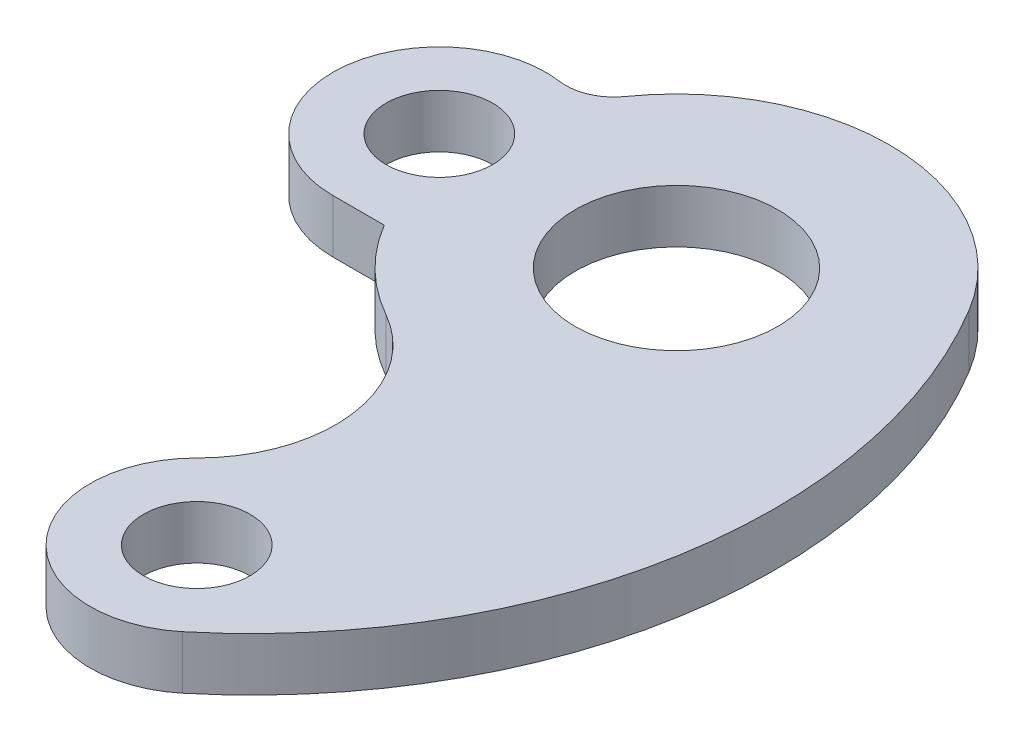
ISO-10303-21;
HEADER;
FILE_DESCRIPTION(('STEP AP214'),'2;1');
FILE_NAME('part.step','',(''),(''),'','','');
FILE_SCHEMA(('AUTOMOTIVE_DESIGN { 1 0 10303 214 1 1 1 1 }'));
ENDSEC;
DATA;
#1=APPLICATION_CONTEXT('core data for automotive mechanical design processes');
#2=APPLICATION_PROTOCOL_DEFINITION('international standard','automotive_design',2000,#1);
#3=PRODUCT_CONTEXT('',#1,'mechanical');
#4=PRODUCT('Part','Part','',(#3));
#5=PRODUCT_RELATED_PRODUCT_CATEGORY('part','',(#4));
#6=PRODUCT_DEFINITION_FORMATION('','',#4);
#7=PRODUCT_DEFINITION_CONTEXT('part definition',#1,'design');
#8=PRODUCT_DEFINITION('design','',#6,#7);
#9=PRODUCT_DEFINITION_SHAPE('','',#8);
#10=(LENGTH_UNIT() NAMED_UNIT(*) SI_UNIT(.MILLI.,.METRE.));
#11=(NAMED_UNIT(*) PLANE_ANGLE_UNIT() SI_UNIT($,.RADIAN.));
#12=(NAMED_UNIT(*) SI_UNIT($,.STERADIAN.) SOLID_ANGLE_UNIT());
#13=UNCERTAINTY_MEASURE_WITH_UNIT(LENGTH_MEASURE(1.E-05),#10,'distance_accuracy_value','');
#14=(GEOMETRIC_REPRESENTATION_CONTEXT(3) GLOBAL_UNCERTAINTY_ASSIGNED_CONTEXT((#13)) GLOBAL_UNIT_ASSIGNED_CONTEXT((#10,
#11,#12)) REPRESENTATION_CONTEXT('',''));
#15=CARTESIAN_POINT('',(0.,0.,0.));
#16=DIRECTION('',(0.,0.,1.));
#17=DIRECTION('',(1.,0.,0.));
#18=AXIS2_PLACEMENT_3D('',#15,#16,#17);
#19=CARTESIAN_POINT('',(-49.7056769492948,10.,29.8888888888889));
#20=DIRECTION('',(0.,-1.,0.));
#21=DIRECTION('',(0.,0.,-1.));
#22=AXIS2_PLACEMENT_3D('',#19,#20,#21);
#23=CYLINDRICAL_SURFACE('',#22,98.);
#24=CARTESIAN_POINT('',(-49.7056769492948,0.,29.8888888888889));
#25=DIRECTION('',(0.,1.,0.));
#26=DIRECTION('',(0.,0.,1.));
#27=AXIS2_PLACEMENT_3D('',#24,#25,#26);
#28=CIRCLE('',#27,98.);
#29=CARTESIAN_POINT('',(12.745045371614,0.,105.413105413105));
#30=VERTEX_POINT('',#29);
#31=CARTESIAN_POINT('',(34.2797772064102,0.,-20.6130268199234));
#32=VERTEX_POINT('',#31);
#33=EDGE_CURVE('E158',#30,#32,#28,.T.);
#34=ORIENTED_EDGE('',*,*,#33,.T.);
#35=DIRECTION('',(0.,-1.,0.));
#36=VECTOR('',#35,1.);
#37=CARTESIAN_POINT('',(34.2797772064102,10.,-20.6130268199234));
#38=LINE('',#37,#36);
#39=CARTESIAN_POINT('',(34.2797772064102,10.,-20.6130268199234));
#40=VERTEX_POINT('',#39);
#41=EDGE_CURVE('E11',#40,#32,#38,.T.);
#42=ORIENTED_EDGE('',*,*,#41,.F.);
#43=CARTESIAN_POINT('',(-49.7056769492948,10.,29.8888888888889));
#44=DIRECTION('',(0.,1.,0.));
#45=DIRECTION('',(0.,0.,1.));
#46=AXIS2_PLACEMENT_3D('',#43,#44,#45);
#47=CIRCLE('',#46,98.);
#48=CARTESIAN_POINT('',(12.745045371614,10.,105.413105413105));
#49=VERTEX_POINT('',#48);
#50=EDGE_CURVE('E225',#49,#40,#47,.T.);
#51=ORIENTED_EDGE('',*,*,#50,.F.);
#52=DIRECTION('',(0.,-1.,0.));
#53=VECTOR('',#52,1.);
#54=CARTESIAN_POINT('',(12.745045371614,10.,105.413105413105));
#55=LINE('',#54,#53);
#56=EDGE_CURVE('E142',#49,#30,#55,.T.);
#57=ORIENTED_EDGE('',*,*,#56,.T.);
#58=EDGE_LOOP('',(#34,#42,#51,#57));
#59=FACE_BOUND('',#58,.T.);
#60=ADVANCED_FACE('F45',(#59),#23,.T.);
#61=CARTESIAN_POINT('',(0.,10.,0.));
#62=DIRECTION('',(0.,-1.,0.));
#63=DIRECTION('',(0.,0.,-1.));
#64=AXIS2_PLACEMENT_3D('',#61,#62,#63);
#65=CYLINDRICAL_SURFACE('',#64,40.);
#66=CARTESIAN_POINT('',(0.,0.,0.));
#67=DIRECTION('',(0.,1.,0.));
#68=DIRECTION('',(0.,0.,1.));
#69=AXIS2_PLACEMENT_3D('',#66,#67,#68);
#70=CIRCLE('',#69,40.);
#71=CARTESIAN_POINT('',(-32.667709837788,0.,-23.0829099975303));
#72=VERTEX_POINT('',#71);
#73=EDGE_CURVE('E162',#32,#72,#70,.T.);
#74=ORIENTED_EDGE('',*,*,#73,.T.);
#75=DIRECTION('',(0.,-1.,0.));
#76=VECTOR('',#75,1.);
#77=CARTESIAN_POINT('',(-32.667709837788,10.,-23.0829099975303));
#78=LINE('',#77,#76);
#79=CARTESIAN_POINT('',(-32.667709837788,10.,-23.0829099975303));
#80=VERTEX_POINT('',#79);
#81=EDGE_CURVE('E55',#80,#72,#78,.T.);
#82=ORIENTED_EDGE('',*,*,#81,.F.);
#83=CARTESIAN_POINT('',(0.,10.,0.));
#84=DIRECTION('',(0.,1.,0.));
#85=DIRECTION('',(0.,0.,1.));
#86=AXIS2_PLACEMENT_3D('',#83,#84,#85);
#87=CIRCLE('',#86,40.);
#88=EDGE_CURVE('E102',#40,#80,#87,.T.);
#89=ORIENTED_EDGE('',*,*,#88,.F.);
#90=ORIENTED_EDGE('',*,*,#41,.T.);
#91=EDGE_LOOP('',(#74,#82,#89,#90));
#92=FACE_BOUND('',#91,.T.);
#93=ADVANCED_FACE('F203',(#92),#65,.T.);
#94=CARTESIAN_POINT('',(-40.0179445512904,10.,-28.2765647469747));
#95=DIRECTION('',(0.,-1.,0.));
#96=DIRECTION('',(0.,0.,-1.));
#97=AXIS2_PLACEMENT_3D('',#94,#95,#96);
#98=CYLINDRICAL_SURFACE('',#97,9.);
#99=CARTESIAN_POINT('',(-40.0179445512904,0.,-28.2765647469747));
#100=DIRECTION('',(0.,1.,0.));
#101=DIRECTION('',(0.,0.,1.));
#102=AXIS2_PLACEMENT_3D('',#99,#100,#101);
#103=CIRCLE('',#102,9.);
#104=CARTESIAN_POINT('',(-41.2675533621198,0.,-19.3637381571718));
#105=VERTEX_POINT('',#104);
#106=EDGE_CURVE('E166',#105,#72,#103,.T.);
#107=ORIENTED_EDGE('',*,*,#106,.F.);
#108=DIRECTION('',(0.,-1.,0.));
#109=VECTOR('',#108,1.);
#110=CARTESIAN_POINT('',(-41.2675533621198,10.,-19.3637381571718));
#111=LINE('',#110,#109);
#112=CARTESIAN_POINT('',(-41.2675533621198,10.,-19.3637381571718));
#113=VERTEX_POINT('',#112);
#114=EDGE_CURVE('E194',#113,#105,#111,.T.);
#115=ORIENTED_EDGE('',*,*,#114,.F.);
#116=CARTESIAN_POINT('',(-40.0179445512904,10.,-28.2765647469747));
#117=DIRECTION('',(0.,1.,0.));
#118=DIRECTION('',(0.,0.,1.));
#119=AXIS2_PLACEMENT_3D('',#116,#117,#118);
#120=CIRCLE('',#119,9.);
#121=EDGE_CURVE('E202',#113,#80,#120,.T.);
#122=ORIENTED_EDGE('',*,*,#121,.T.);
#123=ORIENTED_EDGE('',*,*,#81,.T.);
#124=EDGE_LOOP('',(#107,#115,#122,#123));
#125=FACE_BOUND('',#124,.T.);
#126=ADVANCED_FACE('F200',(#125),#98,.F.);
#127=CARTESIAN_POINT('',(-44.0444618306298,10.,0.442543153501281));
#128=DIRECTION('',(0.,-1.,0.));
#129=DIRECTION('',(0.,0.,-1.));
#130=AXIS2_PLACEMENT_3D('',#127,#128,#129);
#131=CYLINDRICAL_SURFACE('',#130,20.);
#132=CARTESIAN_POINT('',(-44.0444618306298,0.,0.442543153501281));
#133=DIRECTION('',(0.,1.,0.));
#134=DIRECTION('',(0.,0.,1.));
#135=AXIS2_PLACEMENT_3D('',#132,#133,#134);
#136=CIRCLE('',#135,20.);
#137=CARTESIAN_POINT('',(-44.0444618306298,0.,20.4425431535013));
#138=VERTEX_POINT('',#137);
#139=EDGE_CURVE('E170',#105,#138,#136,.T.);
#140=ORIENTED_EDGE('',*,*,#139,.T.);
#141=DIRECTION('',(0.,-1.,0.));
#142=VECTOR('',#141,1.);
#143=CARTESIAN_POINT('',(-44.0444618306298,10.,20.4425431535013));
#144=LINE('',#143,#142);
#145=CARTESIAN_POINT('',(-44.0444618306298,10.,20.4425431535013));
#146=VERTEX_POINT('',#145);
#147=EDGE_CURVE('E190',#146,#138,#144,.T.);
#148=ORIENTED_EDGE('',*,*,#147,.F.);
#149=CARTESIAN_POINT('',(-44.0444618306298,10.,0.442543153501281));
#150=DIRECTION('',(0.,1.,0.));
#151=DIRECTION('',(0.,0.,1.));
#152=AXIS2_PLACEMENT_3D('',#149,#150,#151);
#153=CIRCLE('',#152,20.);
#154=EDGE_CURVE('E217',#113,#146,#153,.T.);
#155=ORIENTED_EDGE('',*,*,#154,.F.);
#156=ORIENTED_EDGE('',*,*,#114,.T.);
#157=EDGE_LOOP('',(#140,#148,#155,#156));
#158=FACE_BOUND('',#157,.T.);
#159=ADVANCED_FACE('F212',(#158),#131,.T.);
#160=CARTESIAN_POINT('',(0.,10.,20.4425431535012));
#161=DIRECTION('',(0.,0.,-1.));
#162=DIRECTION('',(-1.,0.,0.));
#163=AXIS2_PLACEMENT_3D('',#160,#161,#162);
#164=PLANE('',#163);
#165=DIRECTION('',(1.,0.,0.));
#166=VECTOR('',#165,1.);
#167=CARTESIAN_POINT('',(0.,0.,20.4425431535012));
#168=LINE('',#167,#166);
#169=CARTESIAN_POINT('',(-34.3817164989946,0.,20.4425431535013));
#170=VERTEX_POINT('',#169);
#171=EDGE_CURVE('E173',#138,#170,#168,.T.);
#172=ORIENTED_EDGE('',*,*,#171,.T.);
#173=DIRECTION('',(0.,-1.,0.));
#174=VECTOR('',#173,1.);
#175=CARTESIAN_POINT('',(-34.3817164989946,10.,20.4425431535013));
#176=LINE('',#175,#174);
#177=CARTESIAN_POINT('',(-34.3817164989946,10.,20.4425431535013));
#178=VERTEX_POINT('',#177);
#179=EDGE_CURVE('E136',#178,#170,#176,.T.);
#180=ORIENTED_EDGE('',*,*,#179,.F.);
#181=DIRECTION('',(1.,0.,0.));
#182=VECTOR('',#181,1.);
#183=CARTESIAN_POINT('',(0.,10.,20.4425431535012));
#184=LINE('',#183,#182);
#185=EDGE_CURVE('E121',#146,#178,#184,.T.);
#186=ORIENTED_EDGE('',*,*,#185,.F.);
#187=ORIENTED_EDGE('',*,*,#147,.T.);
#188=EDGE_LOOP('',(#172,#180,#186,#187));
#189=FACE_BOUND('',#188,.T.);
#190=ADVANCED_FACE('F215',(#189),#164,.F.);
#191=CARTESIAN_POINT('',(0.,10.,0.));
#192=DIRECTION('',(0.,-1.,0.));
#193=DIRECTION('',(0.,0.,-1.));
#194=AXIS2_PLACEMENT_3D('',#191,#192,#193);
#195=CYLINDRICAL_SURFACE('',#194,40.);
#196=CARTESIAN_POINT('',(0.,0.,0.));
#197=DIRECTION('',(0.,1.,0.));
#198=DIRECTION('',(0.,0.,1.));
#199=AXIS2_PLACEMENT_3D('',#196,#197,#198);
#200=CIRCLE('',#199,40.);
#201=CARTESIAN_POINT('',(-19.6959048893457,0.,34.8148148148148));
#202=VERTEX_POINT('',#201);
#203=EDGE_CURVE('E131',#170,#202,#200,.T.);
#204=ORIENTED_EDGE('',*,*,#203,.T.);
#205=DIRECTION('',(0.,-1.,0.));
#206=VECTOR('',#205,1.);
#207=CARTESIAN_POINT('',(-19.6959048893457,10.,34.8148148148148));
#208=LINE('',#207,#206);
#209=CARTESIAN_POINT('',(-19.6959048893457,10.,34.8148148148148));
#210=VERTEX_POINT('',#209);
#211=EDGE_CURVE('E128',#210,#202,#208,.T.);
#212=ORIENTED_EDGE('',*,*,#211,.F.);
#213=CARTESIAN_POINT('',(0.,10.,0.));
#214=DIRECTION('',(0.,1.,0.));
#215=DIRECTION('',(0.,0.,1.));
#216=AXIS2_PLACEMENT_3D('',#213,#214,#215);
#217=CIRCLE('',#216,40.);
#218=EDGE_CURVE('E115',#178,#210,#217,.T.);
#219=ORIENTED_EDGE('',*,*,#218,.F.);
#220=ORIENTED_EDGE('',*,*,#179,.T.);
#221=EDGE_LOOP('',(#204,#212,#219,#220));
#222=FACE_BOUND('',#221,.T.);
#223=ADVANCED_FACE('F129',(#222),#195,.T.);
#224=CARTESIAN_POINT('',(-32.4982430674203,10.,57.4444444444445));
#225=DIRECTION('',(0.,-1.,0.));
#226=DIRECTION('',(0.,0.,-1.));
#227=AXIS2_PLACEMENT_3D('',#224,#225,#226);
#228=CYLINDRICAL_SURFACE('',#227,26.);
#229=CARTESIAN_POINT('',(-32.4982430674203,0.,57.4444444444445));
#230=DIRECTION('',(0.,1.,0.));
#231=DIRECTION('',(0.,0.,1.));
#232=AXIS2_PLACEMENT_3D('',#229,#230,#231);
#233=CIRCLE('',#232,26.);
#234=CARTESIAN_POINT('',(-14.1296708988784,0.,75.8454106280193));
#235=VERTEX_POINT('',#234);
#236=EDGE_CURVE('E178',#235,#202,#233,.T.);
#237=ORIENTED_EDGE('',*,*,#236,.F.);
#238=DIRECTION('',(0.,-1.,0.));
#239=VECTOR('',#238,1.);
#240=CARTESIAN_POINT('',(-14.1296708988784,10.,75.8454106280193));
#241=LINE('',#240,#239);
#242=CARTESIAN_POINT('',(-14.1296708988784,10.,75.8454106280193));
#243=VERTEX_POINT('',#242);
#244=EDGE_CURVE('E91',#243,#235,#241,.T.);
#245=ORIENTED_EDGE('',*,*,#244,.F.);
#246=CARTESIAN_POINT('',(-32.4982430674203,10.,57.4444444444445));
#247=DIRECTION('',(0.,1.,0.));
#248=DIRECTION('',(0.,0.,1.));
#249=AXIS2_PLACEMENT_3D('',#246,#247,#248);
#250=CIRCLE('',#249,26.);
#251=EDGE_CURVE('E119',#243,#210,#250,.T.);
#252=ORIENTED_EDGE('',*,*,#251,.T.);
#253=ORIENTED_EDGE('',*,*,#211,.T.);
#254=EDGE_LOOP('',(#237,#245,#252,#253));
#255=FACE_BOUND('',#254,.T.);
#256=ADVANCED_FACE('F138',(#255),#228,.F.);
#257=CARTESIAN_POINT('',(0.,10.,90.));
#258=DIRECTION('',(0.,-1.,0.));
#259=DIRECTION('',(0.,0.,-1.));
#260=AXIS2_PLACEMENT_3D('',#257,#258,#259);
#261=CYLINDRICAL_SURFACE('',#260,10.);
#262=CARTESIAN_POINT('',(0.,10.,90.));
#263=DIRECTION('',(0.,1.,0.));
#264=DIRECTION('',(0.,0.,1.));
#265=AXIS2_PLACEMENT_3D('',#262,#263,#264);
#266=CIRCLE('',#265,10.);
#267=CARTESIAN_POINT('',(0.,10.,100.));
#268=VERTEX_POINT('',#267);
#269=EDGE_CURVE('E228',#268,#268,#266,.T.);
#270=ORIENTED_EDGE('',*,*,#269,.T.);
#271=EDGE_LOOP('',(#270));
#272=FACE_BOUND('',#271,.T.);
#273=CARTESIAN_POINT('',(0.,0.,90.));
#274=DIRECTION('',(0.,1.,0.));
#275=DIRECTION('',(0.,0.,1.));
#276=AXIS2_PLACEMENT_3D('',#273,#274,#275);
#277=CIRCLE('',#276,10.);
#278=CARTESIAN_POINT('',(0.,0.,100.));
#279=VERTEX_POINT('',#278);
#280=EDGE_CURVE('E154',#279,#279,#277,.T.);
#281=ORIENTED_EDGE('',*,*,#280,.F.);
#282=EDGE_LOOP('',(#281));
#283=FACE_BOUND('',#282,.T.);
#284=ADVANCED_FACE('F250',(#272,#283),#261,.F.);
#285=CARTESIAN_POINT('',(0.,10.,0.));
#286=DIRECTION('',(0.,-1.,0.));
#287=DIRECTION('',(0.,0.,-1.));
#288=AXIS2_PLACEMENT_3D('',#285,#286,#287);
#289=CYLINDRICAL_SURFACE('',#288,19.);
#290=CARTESIAN_POINT('',(0.,10.,0.));
#291=DIRECTION('',(0.,1.,0.));
#292=DIRECTION('',(0.,0.,1.));
#293=AXIS2_PLACEMENT_3D('',#290,#291,#292);
#294=CIRCLE('',#293,19.);
#295=CARTESIAN_POINT('',(0.,10.,19.));
#296=VERTEX_POINT('',#295);
#297=EDGE_CURVE('E232',#296,#296,#294,.T.);
#298=ORIENTED_EDGE('',*,*,#297,.T.);
#299=EDGE_LOOP('',(#298));
#300=FACE_BOUND('',#299,.T.);
#301=CARTESIAN_POINT('',(0.,0.,0.));
#302=DIRECTION('',(0.,1.,0.));
#303=DIRECTION('',(0.,0.,1.));
#304=AXIS2_PLACEMENT_3D('',#301,#302,#303);
#305=CIRCLE('',#304,19.);
#306=CARTESIAN_POINT('',(0.,0.,19.));
#307=VERTEX_POINT('',#306);
#308=EDGE_CURVE('E150',#307,#307,#305,.T.);
#309=ORIENTED_EDGE('',*,*,#308,.F.);
#310=EDGE_LOOP('',(#309));
#311=FACE_BOUND('',#310,.T.);
#312=ADVANCED_FACE('F253',(#300,#311),#289,.F.);
#313=CARTESIAN_POINT('',(-44.0444618306298,10.,0.442543153501281));
#314=DIRECTION('',(0.,-1.,0.));
#315=DIRECTION('',(0.,0.,-1.));
#316=AXIS2_PLACEMENT_3D('',#313,#314,#315);
#317=CYLINDRICAL_SURFACE('',#316,10.);
#318=CARTESIAN_POINT('',(-44.0444618306298,10.,0.442543153501281));
#319=DIRECTION('',(0.,1.,0.));
#320=DIRECTION('',(0.,0.,1.));
#321=AXIS2_PLACEMENT_3D('',#318,#319,#320);
#322=CIRCLE('',#321,10.);
#323=CARTESIAN_POINT('',(-44.0444618306298,10.,10.4425431535013));
#324=VERTEX_POINT('',#323);
#325=EDGE_CURVE('E183',#324,#324,#322,.T.);
#326=ORIENTED_EDGE('',*,*,#325,.T.);
#327=EDGE_LOOP('',(#326));
#328=FACE_BOUND('',#327,.T.);
#329=CARTESIAN_POINT('',(-44.0444618306298,0.,0.442543153501281));
#330=DIRECTION('',(0.,1.,0.));
#331=DIRECTION('',(0.,0.,1.));
#332=AXIS2_PLACEMENT_3D('',#329,#330,#331);
#333=CIRCLE('',#332,10.);
#334=CARTESIAN_POINT('',(-44.0444618306298,0.,10.4425431535013));
#335=VERTEX_POINT('',#334);
#336=EDGE_CURVE('E146',#335,#335,#333,.T.);
#337=ORIENTED_EDGE('',*,*,#336,.F.);
#338=EDGE_LOOP('',(#337));
#339=FACE_BOUND('',#338,.T.);
#340=ADVANCED_FACE('F47',(#328,#339),#317,.F.);
#341=CARTESIAN_POINT('',(0.,10.,90.));
#342=DIRECTION('',(0.,-1.,0.));
#343=DIRECTION('',(0.,0.,-1.));
#344=AXIS2_PLACEMENT_3D('',#341,#342,#343);
#345=CYLINDRICAL_SURFACE('',#344,20.);
#346=CARTESIAN_POINT('',(0.,0.,90.));
#347=DIRECTION('',(0.,1.,0.));
#348=DIRECTION('',(0.,0.,1.));
#349=AXIS2_PLACEMENT_3D('',#346,#347,#348);
#350=CIRCLE('',#349,20.);
#351=EDGE_CURVE('E94',#235,#30,#350,.T.);
#352=ORIENTED_EDGE('',*,*,#351,.T.);
#353=ORIENTED_EDGE('',*,*,#56,.F.);
#354=CARTESIAN_POINT('',(0.,10.,90.));
#355=DIRECTION('',(0.,1.,0.));
#356=DIRECTION('',(0.,0.,1.));
#357=AXIS2_PLACEMENT_3D('',#354,#355,#356);
#358=CIRCLE('',#357,20.);
#359=EDGE_CURVE('E63',#243,#49,#358,.T.);
#360=ORIENTED_EDGE('',*,*,#359,.F.);
#361=ORIENTED_EDGE('',*,*,#244,.T.);
#362=EDGE_LOOP('',(#352,#353,#360,#361));
#363=FACE_BOUND('',#362,.T.);
#364=ADVANCED_FACE('F244',(#363),#345,.T.);
#365=CARTESIAN_POINT('',(0.,10.,0.));
#366=DIRECTION('',(0.,1.,0.));
#367=DIRECTION('',(0.,0.,1.));
#368=AXIS2_PLACEMENT_3D('',#365,#366,#367);
#369=PLANE('',#368);
#370=ORIENTED_EDGE('',*,*,#325,.F.);
#371=EDGE_LOOP('',(#370));
#372=FACE_BOUND('',#371,.T.);
#373=ORIENTED_EDGE('',*,*,#297,.F.);
#374=EDGE_LOOP('',(#373));
#375=FACE_BOUND('',#374,.T.);
#376=ORIENTED_EDGE('',*,*,#269,.F.);
#377=EDGE_LOOP('',(#376));
#378=FACE_BOUND('',#377,.T.);
#379=ORIENTED_EDGE('',*,*,#50,.T.);
#380=ORIENTED_EDGE('',*,*,#88,.T.);
#381=ORIENTED_EDGE('',*,*,#121,.F.);
#382=ORIENTED_EDGE('',*,*,#154,.T.);
#383=ORIENTED_EDGE('',*,*,#185,.T.);
#384=ORIENTED_EDGE('',*,*,#218,.T.);
#385=ORIENTED_EDGE('',*,*,#251,.F.);
#386=ORIENTED_EDGE('',*,*,#359,.T.);
#387=EDGE_LOOP('',(#379,#380,#381,#382,#383,#384,#385,#386));
#388=FACE_BOUND('',#387,.T.);
#389=ADVANCED_FACE('F117',(#372,#375,#378,#388),#369,.T.);
#390=CARTESIAN_POINT('',(0.,0.,0.));
#391=DIRECTION('',(0.,1.,0.));
#392=DIRECTION('',(0.,0.,1.));
#393=AXIS2_PLACEMENT_3D('',#390,#391,#392);
#394=PLANE('',#393);
#395=ORIENTED_EDGE('',*,*,#336,.T.);
#396=EDGE_LOOP('',(#395));
#397=FACE_BOUND('',#396,.T.);
#398=ORIENTED_EDGE('',*,*,#308,.T.);
#399=EDGE_LOOP('',(#398));
#400=FACE_BOUND('',#399,.T.);
#401=ORIENTED_EDGE('',*,*,#280,.T.);
#402=EDGE_LOOP('',(#401));
#403=FACE_BOUND('',#402,.T.);
#404=ORIENTED_EDGE('',*,*,#33,.F.);
#405=ORIENTED_EDGE('',*,*,#351,.F.);
#406=ORIENTED_EDGE('',*,*,#236,.T.);
#407=ORIENTED_EDGE('',*,*,#203,.F.);
#408=ORIENTED_EDGE('',*,*,#171,.F.);
#409=ORIENTED_EDGE('',*,*,#139,.F.);
#410=ORIENTED_EDGE('',*,*,#106,.T.);
#411=ORIENTED_EDGE('',*,*,#73,.F.);
#412=EDGE_LOOP('',(#404,#405,#406,#407,#408,#409,#410,#411));
#413=FACE_BOUND('',#412,.T.);
#414=ADVANCED_FACE('F208',(#397,#400,#403,#413),#394,.F.);
#415=CLOSED_SHELL('',(#60,#93,#126,#159,#190,#223,#256,#284,#312,#340,#364,#389,#414));
#416=MANIFOLD_SOLID_BREP('B2',#415);
#417=ADVANCED_BREP_SHAPE_REPRESENTATION('',(#18,#416),#14);
#418=SHAPE_DEFINITION_REPRESENTATION(#9,#417);
ENDSEC;
END-ISO-10303-21;
